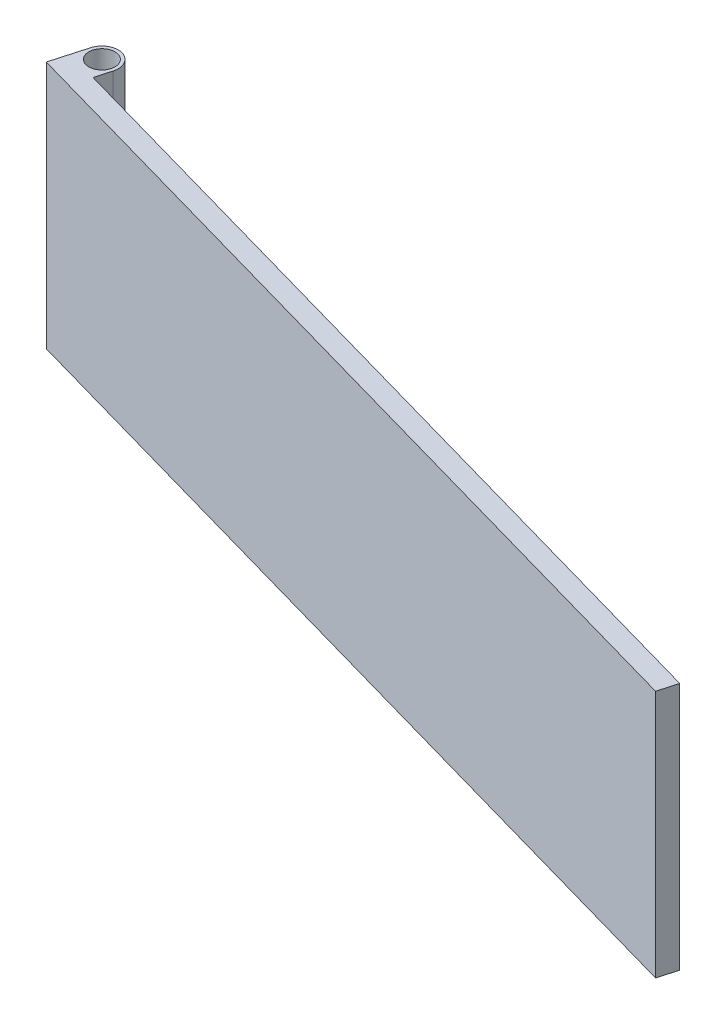
ISO-10303-21;
HEADER;
FILE_DESCRIPTION(('STEP AP214'),'2;1');
FILE_NAME('part.step','',(''),(''),'','','');
FILE_SCHEMA(('AUTOMOTIVE_DESIGN { 1 0 10303 214 1 1 1 1 }'));
ENDSEC;
DATA;
#1=APPLICATION_CONTEXT('core data for automotive mechanical design processes');
#2=APPLICATION_PROTOCOL_DEFINITION('international standard','automotive_design',2000,#1);
#3=PRODUCT_CONTEXT('',#1,'mechanical');
#4=PRODUCT('Part','Part','',(#3));
#5=PRODUCT_RELATED_PRODUCT_CATEGORY('part','',(#4));
#6=PRODUCT_DEFINITION_FORMATION('','',#4);
#7=PRODUCT_DEFINITION_CONTEXT('part definition',#1,'design');
#8=PRODUCT_DEFINITION('design','',#6,#7);
#9=PRODUCT_DEFINITION_SHAPE('','',#8);
#10=(LENGTH_UNIT() NAMED_UNIT(*) SI_UNIT(.MILLI.,.METRE.));
#11=(NAMED_UNIT(*) PLANE_ANGLE_UNIT() SI_UNIT($,.RADIAN.));
#12=(NAMED_UNIT(*) SI_UNIT($,.STERADIAN.) SOLID_ANGLE_UNIT());
#13=UNCERTAINTY_MEASURE_WITH_UNIT(LENGTH_MEASURE(1.E-05),#10,'distance_accuracy_value','');
#14=(GEOMETRIC_REPRESENTATION_CONTEXT(3) GLOBAL_UNCERTAINTY_ASSIGNED_CONTEXT((#13)) GLOBAL_UNIT_ASSIGNED_CONTEXT((#10,
#11,#12)) REPRESENTATION_CONTEXT('',''));
#15=CARTESIAN_POINT('',(0.,0.,0.));
#16=DIRECTION('',(0.,0.,1.));
#17=DIRECTION('',(1.,0.,0.));
#18=AXIS2_PLACEMENT_3D('',#15,#16,#17);
#19=CARTESIAN_POINT('',(-5.60113821836263,1.9,6.11628696544364));
#20=DIRECTION('',(0.962248672431212,0.,0.27217180677721));
#21=DIRECTION('',(0.27217180677721,0.,-0.962248672431212));
#22=AXIS2_PLACEMENT_3D('',#19,#20,#21);
#23=PLANE('',#22);
#24=DIRECTION('',(0.,1.,0.));
#25=VECTOR('',#24,1.);
#26=CARTESIAN_POINT('',(-5.73722412175123,0.,6.59741130165925));
#27=LINE('',#26,#25);
#28=CARTESIAN_POINT('',(-5.73722412175123,-1.9,6.59741130165924));
#29=VERTEX_POINT('',#28);
#30=CARTESIAN_POINT('',(-5.73722412175123,1.9,6.59741130165925));
#31=VERTEX_POINT('',#30);
#32=EDGE_CURVE('E83',#29,#31,#27,.T.);
#33=ORIENTED_EDGE('',*,*,#32,.F.);
#34=DIRECTION('',(0.27217180677721,0.,-0.962248672431212));
#35=VECTOR('',#34,1.);
#36=CARTESIAN_POINT('',(-5.60113821836263,-1.9,6.11628696544364));
#37=LINE('',#36,#35);
#38=CARTESIAN_POINT('',(-5.66918117005693,-1.9,6.35684913355144));
#39=VERTEX_POINT('',#38);
#40=EDGE_CURVE('E70',#29,#39,#37,.T.);
#41=ORIENTED_EDGE('',*,*,#40,.T.);
#42=DIRECTION('',(0.,-1.,0.));
#43=VECTOR('',#42,1.);
#44=CARTESIAN_POINT('',(-5.66918117005693,1.9,6.35684913355144));
#45=LINE('',#44,#43);
#46=CARTESIAN_POINT('',(-5.66918117005693,1.9,6.35684913355144));
#47=VERTEX_POINT('',#46);
#48=EDGE_CURVE('E80',#47,#39,#45,.T.);
#49=ORIENTED_EDGE('',*,*,#48,.F.);
#50=DIRECTION('',(0.27217180677721,0.,-0.962248672431212));
#51=VECTOR('',#50,1.);
#52=CARTESIAN_POINT('',(-5.60113821836263,1.9,6.11628696544364));
#53=LINE('',#52,#51);
#54=EDGE_CURVE('E85',#47,#31,#53,.F.);
#55=ORIENTED_EDGE('',*,*,#54,.T.);
#56=EDGE_LOOP('',(#33,#41,#49,#55));
#57=FACE_BOUND('',#56,.T.);
#58=ADVANCED_FACE('F17',(#57),#23,.T.);
#59=CARTESIAN_POINT('',(-5.90974333816473,1.9,6.28880618185714));
#60=DIRECTION('',(0.,-1.,0.));
#61=DIRECTION('',(0.,0.,-1.));
#62=AXIS2_PLACEMENT_3D('',#59,#60,#61);
#63=CYLINDRICAL_SURFACE('',#62,0.25);
#64=CARTESIAN_POINT('',(-5.90974333816473,1.9,6.28880618185714));
#65=DIRECTION('',(0.,-1.,0.));
#66=DIRECTION('',(0.,0.,-1.));
#67=AXIS2_PLACEMENT_3D('',#64,#65,#66);
#68=CIRCLE('',#67,0.25);
#69=CARTESIAN_POINT('',(-6.15030550627254,1.9,6.22076323016284));
#70=VERTEX_POINT('',#69);
#71=EDGE_CURVE('E77',#70,#47,#68,.T.);
#72=ORIENTED_EDGE('',*,*,#71,.T.);
#73=ORIENTED_EDGE('',*,*,#48,.T.);
#74=CARTESIAN_POINT('',(-5.90974333816473,-1.9,6.28880618185714));
#75=DIRECTION('',(0.,-1.,0.));
#76=DIRECTION('',(0.,0.,-1.));
#77=AXIS2_PLACEMENT_3D('',#74,#75,#76);
#78=CIRCLE('',#77,0.25);
#79=CARTESIAN_POINT('',(-6.15030550627254,-1.9,6.22076323016284));
#80=VERTEX_POINT('',#79);
#81=EDGE_CURVE('E20',#39,#80,#78,.F.);
#82=ORIENTED_EDGE('',*,*,#81,.T.);
#83=DIRECTION('',(0.,1.,0.));
#84=VECTOR('',#83,1.);
#85=CARTESIAN_POINT('',(-6.15030550627253,-1.9,6.22076323016283));
#86=LINE('',#85,#84);
#87=EDGE_CURVE('E89',#70,#80,#86,.F.);
#88=ORIENTED_EDGE('',*,*,#87,.F.);
#89=EDGE_LOOP('',(#72,#73,#82,#88));
#90=FACE_BOUND('',#89,.T.);
#91=ADVANCED_FACE('F87',(#90),#63,.T.);
#92=CARTESIAN_POINT('',(0.281651542033163,0.,8.29984884313238));
#93=DIRECTION('',(0.27217180677721,0.,-0.962248672431212));
#94=DIRECTION('',(-0.962248672431212,0.,-0.27217180677721));
#95=AXIS2_PLACEMENT_3D('',#92,#93,#94);
#96=PLANE('',#95);
#97=DIRECTION('',(0.,1.,0.));
#98=VECTOR('',#97,1.);
#99=CARTESIAN_POINT('',(6.78165154203317,1.9,10.1383722879941));
#100=LINE('',#99,#98);
#101=CARTESIAN_POINT('',(6.78165154203317,-1.9,10.1383722879941));
#102=VERTEX_POINT('',#101);
#103=CARTESIAN_POINT('',(6.78165154203317,1.9,10.1383722879941));
#104=VERTEX_POINT('',#103);
#105=EDGE_CURVE('E121',#102,#104,#100,.T.);
#106=ORIENTED_EDGE('',*,*,#105,.F.);
#107=DIRECTION('',(0.962248672431212,0.,0.272171806777209));
#108=VECTOR('',#107,1.);
#109=CARTESIAN_POINT('',(-5.73722412175123,-1.9,6.59741130165924));
#110=LINE('',#109,#108);
#111=EDGE_CURVE('E102',#29,#102,#110,.T.);
#112=ORIENTED_EDGE('',*,*,#111,.F.);
#113=ORIENTED_EDGE('',*,*,#32,.T.);
#114=DIRECTION('',(-0.962248672431212,0.,-0.272171806777209));
#115=VECTOR('',#114,1.);
#116=CARTESIAN_POINT('',(6.78165154203317,1.9,10.1383722879941));
#117=LINE('',#116,#115);
#118=EDGE_CURVE('E106',#104,#31,#117,.T.);
#119=ORIENTED_EDGE('',*,*,#118,.F.);
#120=EDGE_LOOP('',(#106,#112,#113,#119));
#121=FACE_BOUND('',#120,.T.);
#122=ADVANCED_FACE('F149',(#121),#96,.T.);
#123=CARTESIAN_POINT('',(-5.90974333816473,1.9,6.28880618185714));
#124=DIRECTION('',(0.,-1.,0.));
#125=DIRECTION('',(0.,0.,-1.));
#126=AXIS2_PLACEMENT_3D('',#123,#124,#125);
#127=CYLINDRICAL_SURFACE('',#126,0.2);
#128=CARTESIAN_POINT('',(-5.90974333816473,-1.9,6.28880618185714));
#129=DIRECTION('',(0.,-1.,0.));
#130=DIRECTION('',(0.,0.,-1.));
#131=AXIS2_PLACEMENT_3D('',#128,#129,#130);
#132=CIRCLE('',#131,0.2);
#133=CARTESIAN_POINT('',(-5.90974333816473,-1.9,6.08880618185714));
#134=VERTEX_POINT('',#133);
#135=EDGE_CURVE('E115',#134,#134,#132,.F.);
#136=ORIENTED_EDGE('',*,*,#135,.F.);
#137=EDGE_LOOP('',(#136));
#138=FACE_BOUND('',#137,.T.);
#139=CARTESIAN_POINT('',(-5.90974333816473,1.9,6.28880618185714));
#140=DIRECTION('',(0.,-1.,0.));
#141=DIRECTION('',(0.,0.,-1.));
#142=AXIS2_PLACEMENT_3D('',#139,#140,#141);
#143=CIRCLE('',#142,0.2);
#144=CARTESIAN_POINT('',(-5.90974333816473,1.9,6.08880618185714));
#145=VERTEX_POINT('',#144);
#146=EDGE_CURVE('E109',#145,#145,#143,.T.);
#147=ORIENTED_EDGE('',*,*,#146,.F.);
#148=EDGE_LOOP('',(#147));
#149=FACE_BOUND('',#148,.T.);
#150=ADVANCED_FACE('F157',(#138,#149),#127,.F.);
#151=CARTESIAN_POINT('',(-6.3,-1.9,6.75));
#152=DIRECTION('',(-0.962248672431212,0.,-0.27217180677721));
#153=DIRECTION('',(-0.27217180677721,0.,0.962248672431212));
#154=AXIS2_PLACEMENT_3D('',#151,#152,#153);
#155=PLANE('',#154);
#156=DIRECTION('',(0.,1.,0.));
#157=VECTOR('',#156,1.);
#158=CARTESIAN_POINT('',(-6.3,0.,6.75));
#159=LINE('',#158,#157);
#160=CARTESIAN_POINT('',(-6.3,1.9,6.75));
#161=VERTEX_POINT('',#160);
#162=CARTESIAN_POINT('',(-6.3,-1.9,6.75));
#163=VERTEX_POINT('',#162);
#164=EDGE_CURVE('E114',#161,#163,#159,.F.);
#165=ORIENTED_EDGE('',*,*,#164,.F.);
#166=DIRECTION('',(-0.2721718067772,0.,0.962248672431214));
#167=VECTOR('',#166,1.);
#168=CARTESIAN_POINT('',(-6.15030550627254,1.9,6.22076323016283));
#169=LINE('',#168,#167);
#170=EDGE_CURVE('E141',#70,#161,#169,.T.);
#171=ORIENTED_EDGE('',*,*,#170,.F.);
#172=ORIENTED_EDGE('',*,*,#87,.T.);
#173=DIRECTION('',(0.2721718067772,0.,-0.962248672431214));
#174=VECTOR('',#173,1.);
#175=CARTESIAN_POINT('',(-6.3,-1.9,6.75));
#176=LINE('',#175,#174);
#177=EDGE_CURVE('E72',#163,#80,#176,.T.);
#178=ORIENTED_EDGE('',*,*,#177,.F.);
#179=EDGE_LOOP('',(#165,#171,#172,#178));
#180=FACE_BOUND('',#179,.T.);
#181=ADVANCED_FACE('F155',(#180),#155,.T.);
#182=CARTESIAN_POINT('',(6.7,-1.9,10.4270468897235));
#183=DIRECTION('',(0.,-1.,0.));
#184=DIRECTION('',(1.,0.,0.));
#185=AXIS2_PLACEMENT_3D('',#182,#183,#184);
#186=PLANE('',#185);
#187=ORIENTED_EDGE('',*,*,#135,.T.);
#188=EDGE_LOOP('',(#187));
#189=FACE_BOUND('',#188,.T.);
#190=DIRECTION('',(0.962248672431212,0.,0.27217180677721));
#191=VECTOR('',#190,1.);
#192=CARTESIAN_POINT('',(0.199999999999999,-1.9,8.58852344486174));
#193=LINE('',#192,#191);
#194=CARTESIAN_POINT('',(6.7,-1.9,10.4270468897235));
#195=VERTEX_POINT('',#194);
#196=EDGE_CURVE('E131',#163,#195,#193,.T.);
#197=ORIENTED_EDGE('',*,*,#196,.F.);
#198=ORIENTED_EDGE('',*,*,#177,.T.);
#199=ORIENTED_EDGE('',*,*,#81,.F.);
#200=ORIENTED_EDGE('',*,*,#40,.F.);
#201=ORIENTED_EDGE('',*,*,#111,.T.);
#202=DIRECTION('',(0.27217180677721,0.,-0.962248672431212));
#203=VECTOR('',#202,1.);
#204=CARTESIAN_POINT('',(6.7,-1.9,10.4270468897235));
#205=LINE('',#204,#203);
#206=EDGE_CURVE('E117',#195,#102,#205,.T.);
#207=ORIENTED_EDGE('',*,*,#206,.F.);
#208=EDGE_LOOP('',(#197,#198,#199,#200,#201,#207));
#209=FACE_BOUND('',#208,.T.);
#210=ADVANCED_FACE('F69',(#189,#209),#186,.T.);
#211=CARTESIAN_POINT('',(6.7,1.9,10.4270468897235));
#212=DIRECTION('',(0.962248672431212,0.,0.27217180677721));
#213=DIRECTION('',(0.27217180677721,0.,-0.962248672431212));
#214=AXIS2_PLACEMENT_3D('',#211,#212,#213);
#215=PLANE('',#214);
#216=ORIENTED_EDGE('',*,*,#105,.T.);
#217=DIRECTION('',(0.272171806777202,0.,-0.962248672431214));
#218=VECTOR('',#217,1.);
#219=CARTESIAN_POINT('',(6.7,1.9,10.4270468897235));
#220=LINE('',#219,#218);
#221=CARTESIAN_POINT('',(6.7,1.9,10.4270468897235));
#222=VERTEX_POINT('',#221);
#223=EDGE_CURVE('E35',#222,#104,#220,.T.);
#224=ORIENTED_EDGE('',*,*,#223,.F.);
#225=DIRECTION('',(0.,1.,0.));
#226=VECTOR('',#225,1.);
#227=CARTESIAN_POINT('',(6.70000000000001,0.,10.4270468897235));
#228=LINE('',#227,#226);
#229=EDGE_CURVE('E26',#195,#222,#228,.T.);
#230=ORIENTED_EDGE('',*,*,#229,.F.);
#231=ORIENTED_EDGE('',*,*,#206,.T.);
#232=EDGE_LOOP('',(#216,#224,#230,#231));
#233=FACE_BOUND('',#232,.T.);
#234=ADVANCED_FACE('F147',(#233),#215,.T.);
#235=CARTESIAN_POINT('',(-6.3,1.9,6.75));
#236=DIRECTION('',(0.,1.,0.));
#237=DIRECTION('',(-1.,0.,0.));
#238=AXIS2_PLACEMENT_3D('',#235,#236,#237);
#239=PLANE('',#238);
#240=ORIENTED_EDGE('',*,*,#146,.T.);
#241=EDGE_LOOP('',(#240));
#242=FACE_BOUND('',#241,.T.);
#243=ORIENTED_EDGE('',*,*,#118,.T.);
#244=ORIENTED_EDGE('',*,*,#54,.F.);
#245=ORIENTED_EDGE('',*,*,#71,.F.);
#246=ORIENTED_EDGE('',*,*,#170,.T.);
#247=DIRECTION('',(0.962248672431212,0.,0.27217180677721));
#248=VECTOR('',#247,1.);
#249=CARTESIAN_POINT('',(0.199999999999999,1.9,8.58852344486174));
#250=LINE('',#249,#248);
#251=EDGE_CURVE('E11',#222,#161,#250,.F.);
#252=ORIENTED_EDGE('',*,*,#251,.F.);
#253=ORIENTED_EDGE('',*,*,#223,.T.);
#254=EDGE_LOOP('',(#243,#244,#245,#246,#252,#253));
#255=FACE_BOUND('',#254,.T.);
#256=ADVANCED_FACE('F151',(#242,#255),#239,.T.);
#257=CARTESIAN_POINT('',(0.199999999999999,0.,8.58852344486174));
#258=DIRECTION('',(-0.27217180677721,0.,0.962248672431212));
#259=DIRECTION('',(0.962248672431212,0.,0.27217180677721));
#260=AXIS2_PLACEMENT_3D('',#257,#258,#259);
#261=PLANE('',#260);
#262=ORIENTED_EDGE('',*,*,#229,.T.);
#263=ORIENTED_EDGE('',*,*,#251,.T.);
#264=ORIENTED_EDGE('',*,*,#164,.T.);
#265=ORIENTED_EDGE('',*,*,#196,.T.);
#266=EDGE_LOOP('',(#262,#263,#264,#265));
#267=FACE_BOUND('',#266,.T.);
#268=ADVANCED_FACE('F153',(#267),#261,.T.);
#269=CLOSED_SHELL('',(#58,#91,#122,#150,#181,#210,#234,#256,#268));
#270=MANIFOLD_SOLID_BREP('B1',#269);
#271=ADVANCED_BREP_SHAPE_REPRESENTATION('',(#18,#270),#14);
#272=SHAPE_DEFINITION_REPRESENTATION(#9,#271);
ENDSEC;
END-ISO-10303-21;
